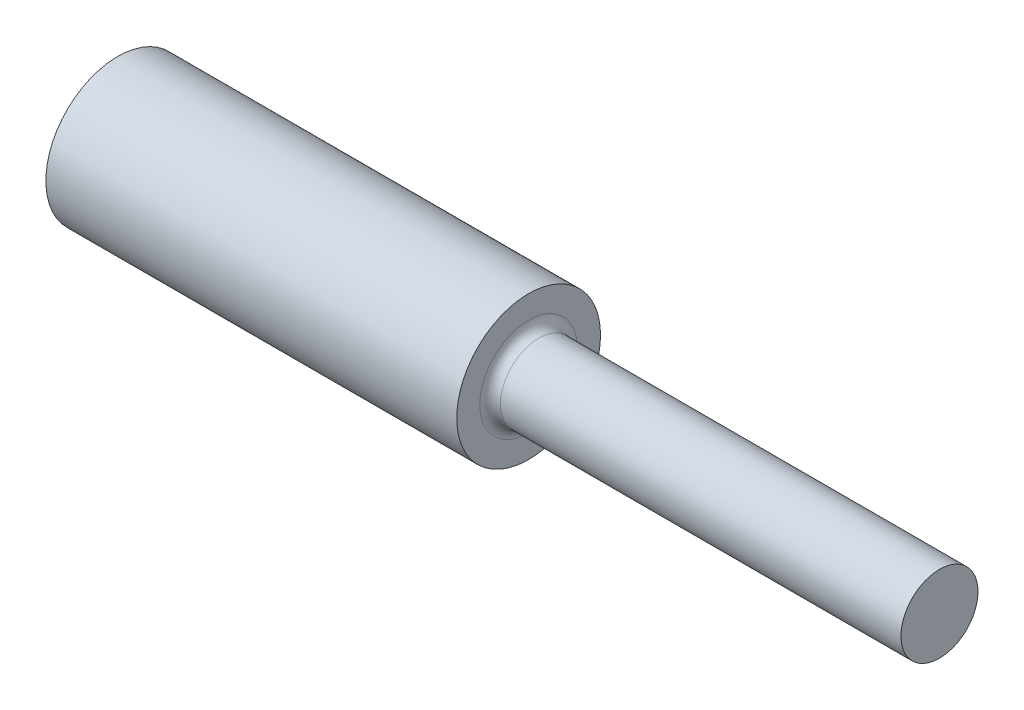
ISO-10303-21;
HEADER;
FILE_DESCRIPTION(('STEP AP214'),'2;1');
FILE_NAME('part.step','',(''),(''),'','','');
FILE_SCHEMA(('AUTOMOTIVE_DESIGN { 1 0 10303 214 1 1 1 1 }'));
ENDSEC;
DATA;
#1=APPLICATION_CONTEXT('core data for automotive mechanical design processes');
#2=APPLICATION_PROTOCOL_DEFINITION('international standard','automotive_design',2000,#1);
#3=PRODUCT_CONTEXT('',#1,'mechanical');
#4=PRODUCT('Part','Part','',(#3));
#5=PRODUCT_RELATED_PRODUCT_CATEGORY('part','',(#4));
#6=PRODUCT_DEFINITION_FORMATION('','',#4);
#7=PRODUCT_DEFINITION_CONTEXT('part definition',#1,'design');
#8=PRODUCT_DEFINITION('design','',#6,#7);
#9=PRODUCT_DEFINITION_SHAPE('','',#8);
#10=(LENGTH_UNIT() NAMED_UNIT(*) SI_UNIT(.MILLI.,.METRE.));
#11=(NAMED_UNIT(*) PLANE_ANGLE_UNIT() SI_UNIT($,.RADIAN.));
#12=(NAMED_UNIT(*) SI_UNIT($,.STERADIAN.) SOLID_ANGLE_UNIT());
#13=UNCERTAINTY_MEASURE_WITH_UNIT(LENGTH_MEASURE(1.E-05),#10,'distance_accuracy_value','');
#14=(GEOMETRIC_REPRESENTATION_CONTEXT(3) GLOBAL_UNCERTAINTY_ASSIGNED_CONTEXT((#13)) GLOBAL_UNIT_ASSIGNED_CONTEXT((#10,
#11,#12)) REPRESENTATION_CONTEXT('',''));
#15=CARTESIAN_POINT('',(0.,0.,0.));
#16=DIRECTION('',(0.,0.,1.));
#17=DIRECTION('',(1.,0.,0.));
#18=AXIS2_PLACEMENT_3D('',#15,#16,#17);
#19=CARTESIAN_POINT('',(101.6,0.,0.));
#20=DIRECTION('',(-1.,0.,0.));
#21=DIRECTION('',(0.,0.,1.));
#22=AXIS2_PLACEMENT_3D('',#19,#20,#21);
#23=PLANE('',#22);
#24=CARTESIAN_POINT('',(101.6,0.,0.));
#25=DIRECTION('',(1.,0.,0.));
#26=DIRECTION('',(0.,0.,-1.));
#27=AXIS2_PLACEMENT_3D('',#24,#25,#26);
#28=CIRCLE('',#27,9.525);
#29=CARTESIAN_POINT('',(101.6,0.,-9.525));
#30=VERTEX_POINT('',#29);
#31=EDGE_CURVE('E49',#30,#30,#28,.T.);
#32=ORIENTED_EDGE('',*,*,#31,.T.);
#33=EDGE_LOOP('',(#32));
#34=FACE_BOUND('',#33,.T.);
#35=ADVANCED_FACE('F37',(#34),#23,.F.);
#36=CARTESIAN_POINT('',(60.4108108108108,0.,0.));
#37=DIRECTION('',(1.,0.,0.));
#38=DIRECTION('',(0.,0.,-1.));
#39=AXIS2_PLACEMENT_3D('',#36,#37,#38);
#40=CYLINDRICAL_SURFACE('',#39,9.525);
#41=CARTESIAN_POINT('',(2.54,0.,0.));
#42=DIRECTION('',(-1.,0.,0.));
#43=DIRECTION('',(0.,0.,1.));
#44=AXIS2_PLACEMENT_3D('',#41,#42,#43);
#45=CIRCLE('',#44,9.525);
#46=CARTESIAN_POINT('',(2.54,0.,9.525));
#47=VERTEX_POINT('',#46);
#48=EDGE_CURVE('E45',#47,#47,#45,.F.);
#49=ORIENTED_EDGE('',*,*,#48,.T.);
#50=EDGE_LOOP('',(#49));
#51=FACE_BOUND('',#50,.T.);
#52=ORIENTED_EDGE('',*,*,#31,.F.);
#53=EDGE_LOOP('',(#52));
#54=FACE_BOUND('',#53,.T.);
#55=ADVANCED_FACE('F76',(#51,#54),#40,.T.);
#56=CARTESIAN_POINT('',(0.,9.525,0.));
#57=DIRECTION('',(-1.,0.,0.));
#58=DIRECTION('',(0.,0.,1.));
#59=AXIS2_PLACEMENT_3D('',#56,#57,#58);
#60=PLANE('',#59);
#61=CARTESIAN_POINT('',(0.,0.,0.));
#62=DIRECTION('',(-1.,0.,0.));
#63=DIRECTION('',(0.,0.,1.));
#64=AXIS2_PLACEMENT_3D('',#61,#62,#63);
#65=CIRCLE('',#64,12.065);
#66=CARTESIAN_POINT('',(0.,0.,12.065));
#67=VERTEX_POINT('',#66);
#68=EDGE_CURVE('E11',#67,#67,#65,.T.);
#69=ORIENTED_EDGE('',*,*,#68,.T.);
#70=EDGE_LOOP('',(#69));
#71=FACE_BOUND('',#70,.T.);
#72=CARTESIAN_POINT('',(0.,0.,0.));
#73=DIRECTION('',(1.,0.,0.));
#74=DIRECTION('',(0.,0.,-1.));
#75=AXIS2_PLACEMENT_3D('',#72,#73,#74);
#76=CIRCLE('',#75,17.78);
#77=CARTESIAN_POINT('',(0.,0.,-17.78));
#78=VERTEX_POINT('',#77);
#79=EDGE_CURVE('E53',#78,#78,#76,.T.);
#80=ORIENTED_EDGE('',*,*,#79,.T.);
#81=EDGE_LOOP('',(#80));
#82=FACE_BOUND('',#81,.T.);
#83=ADVANCED_FACE('F72',(#71,#82),#60,.F.);
#84=CARTESIAN_POINT('',(60.4108108108108,0.,0.));
#85=DIRECTION('',(1.,0.,0.));
#86=DIRECTION('',(0.,0.,-1.));
#87=AXIS2_PLACEMENT_3D('',#84,#85,#86);
#88=CYLINDRICAL_SURFACE('',#87,17.78);
#89=ORIENTED_EDGE('',*,*,#79,.F.);
#90=EDGE_LOOP('',(#89));
#91=FACE_BOUND('',#90,.T.);
#92=CARTESIAN_POINT('',(-101.6,0.,0.));
#93=DIRECTION('',(1.,0.,0.));
#94=DIRECTION('',(0.,0.,-1.));
#95=AXIS2_PLACEMENT_3D('',#92,#93,#94);
#96=CIRCLE('',#95,17.78);
#97=CARTESIAN_POINT('',(-101.6,0.,-17.78));
#98=VERTEX_POINT('',#97);
#99=EDGE_CURVE('E58',#98,#98,#96,.T.);
#100=ORIENTED_EDGE('',*,*,#99,.T.);
#101=EDGE_LOOP('',(#100));
#102=FACE_BOUND('',#101,.T.);
#103=ADVANCED_FACE('F62',(#91,#102),#88,.T.);
#104=CARTESIAN_POINT('',(-101.6,17.78,0.));
#105=DIRECTION('',(1.,0.,0.));
#106=DIRECTION('',(0.,0.,-1.));
#107=AXIS2_PLACEMENT_3D('',#104,#105,#106);
#108=PLANE('',#107);
#109=ORIENTED_EDGE('',*,*,#99,.F.);
#110=EDGE_LOOP('',(#109));
#111=FACE_BOUND('',#110,.T.);
#112=ADVANCED_FACE('F64',(#111),#108,.F.);
#113=CARTESIAN_POINT('',(2.54,0.,0.));
#114=DIRECTION('',(-1.,0.,0.));
#115=DIRECTION('',(0.,0.,1.));
#116=AXIS2_PLACEMENT_3D('',#113,#114,#115);
#117=TOROIDAL_SURFACE('',#116,12.065,2.54);
#118=ORIENTED_EDGE('',*,*,#68,.F.);
#119=EDGE_LOOP('',(#118));
#120=FACE_BOUND('',#119,.T.);
#121=ORIENTED_EDGE('',*,*,#48,.F.);
#122=EDGE_LOOP('',(#121));
#123=FACE_BOUND('',#122,.T.);
#124=ADVANCED_FACE('F39',(#120,#123),#117,.F.);
#125=CLOSED_SHELL('',(#35,#55,#83,#103,#112,#124));
#126=MANIFOLD_SOLID_BREP('B2',#125);
#127=ADVANCED_BREP_SHAPE_REPRESENTATION('',(#18,#126),#14);
#128=SHAPE_DEFINITION_REPRESENTATION(#9,#127);
ENDSEC;
END-ISO-10303-21;
